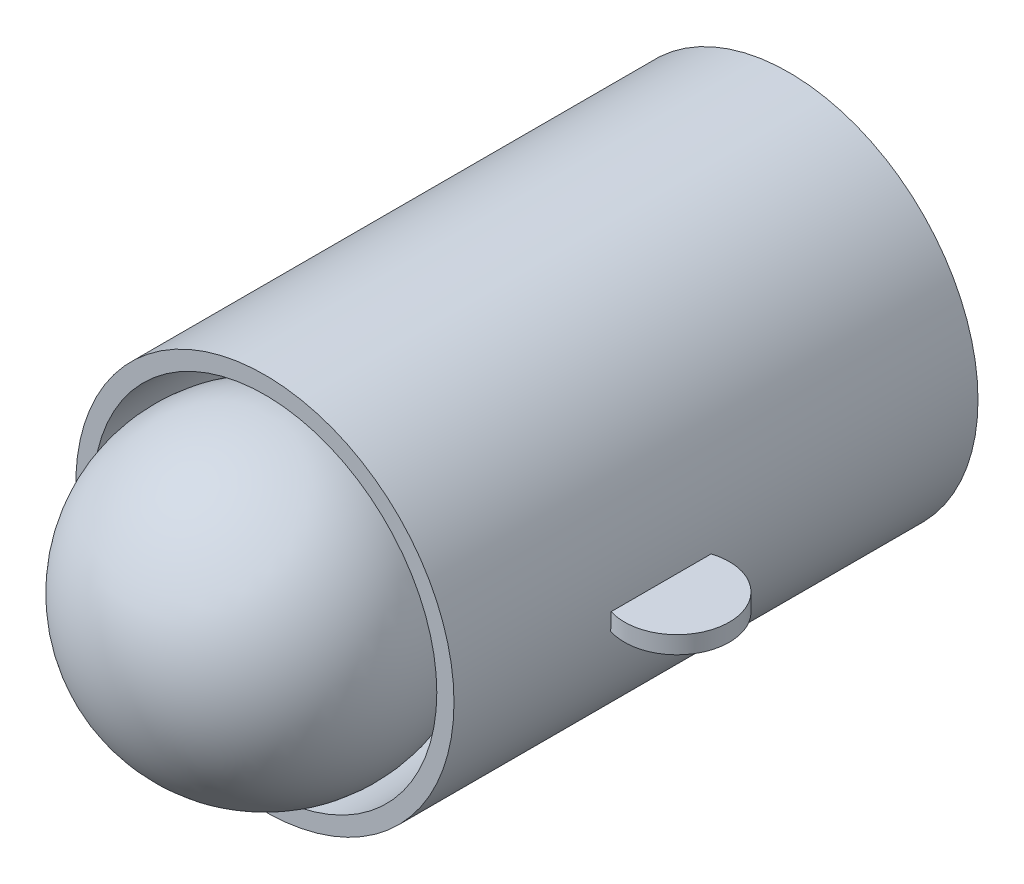
ISO-10303-21;
HEADER;
FILE_DESCRIPTION(('STEP AP214'),'2;1');
FILE_NAME('part.step','',(''),(''),'','','');
FILE_SCHEMA(('AUTOMOTIVE_DESIGN { 1 0 10303 214 1 1 1 1 }'));
ENDSEC;
DATA;
#1=APPLICATION_CONTEXT('core data for automotive mechanical design processes');
#2=APPLICATION_PROTOCOL_DEFINITION('international standard','automotive_design',2000,#1);
#3=PRODUCT_CONTEXT('',#1,'mechanical');
#4=PRODUCT('Part','Part','',(#3));
#5=PRODUCT_RELATED_PRODUCT_CATEGORY('part','',(#4));
#6=PRODUCT_DEFINITION_FORMATION('','',#4);
#7=PRODUCT_DEFINITION_CONTEXT('part definition',#1,'design');
#8=PRODUCT_DEFINITION('design','',#6,#7);
#9=PRODUCT_DEFINITION_SHAPE('','',#8);
#10=(LENGTH_UNIT() NAMED_UNIT(*) SI_UNIT(.MILLI.,.METRE.));
#11=(NAMED_UNIT(*) PLANE_ANGLE_UNIT() SI_UNIT($,.RADIAN.));
#12=(NAMED_UNIT(*) SI_UNIT($,.STERADIAN.) SOLID_ANGLE_UNIT());
#13=UNCERTAINTY_MEASURE_WITH_UNIT(LENGTH_MEASURE(1.E-05),#10,'distance_accuracy_value','');
#14=(GEOMETRIC_REPRESENTATION_CONTEXT(3) GLOBAL_UNCERTAINTY_ASSIGNED_CONTEXT((#13)) GLOBAL_UNIT_ASSIGNED_CONTEXT((#10,
#11,#12)) REPRESENTATION_CONTEXT('',''));
#15=CARTESIAN_POINT('',(0.,0.,0.));
#16=DIRECTION('',(0.,0.,1.));
#17=DIRECTION('',(1.,0.,0.));
#18=AXIS2_PLACEMENT_3D('',#15,#16,#17);
#19=CARTESIAN_POINT('',(0.,0.,76.2));
#20=DIRECTION('',(0.,1.,0.));
#21=DIRECTION('',(1.,0.,0.));
#22=AXIS2_PLACEMENT_3D('',#19,#20,#21);
#23=SPHERICAL_SURFACE('',#22,22.54);
#24=CARTESIAN_POINT('',(0.,22.54,76.2));
#25=VERTEX_POINT('',#24);
#26=VERTEX_LOOP('',#25);
#27=FACE_BOUND('',#26,.T.);
#28=ADVANCED_FACE('F43',(#27),#23,.T.);
#29=CLOSED_SHELL('',(#28));
#30=CARTESIAN_POINT('',(0.,0.,76.2));
#31=DIRECTION('',(0.,1.,0.));
#32=DIRECTION('',(1.,0.,0.));
#33=AXIS2_PLACEMENT_3D('',#30,#31,#32);
#34=SPHERICAL_SURFACE('',#33,20.);
#35=CARTESIAN_POINT('',(0.,20.,76.2));
#36=VERTEX_POINT('',#35);
#37=VERTEX_LOOP('',#36);
#38=FACE_BOUND('',#37,.T.);
#39=ADVANCED_FACE('F55',(#38),#34,.F.);
#40=CLOSED_SHELL('',(#39));
#41=ORIENTED_CLOSED_SHELL('',*,#40,.T.);
#42=BREP_WITH_VOIDS('B2',#29,(#41));
#43=CARTESIAN_POINT('',(0.,0.,76.2));
#44=DIRECTION('',(0.,0.,-1.));
#45=DIRECTION('',(-1.,0.,0.));
#46=AXIS2_PLACEMENT_3D('',#43,#44,#45);
#47=CYLINDRICAL_SURFACE('',#46,27.5);
#48=CARTESIAN_POINT('',(27.3824469322959,-2.54,38.8446913125485));
#49=CARTESIAN_POINT('',(27.402025367291,-2.32894215483723,38.8381673141535));
#50=CARTESIAN_POINT('',(27.4191647416801,-2.11763131286099,38.8325338603298));
#51=CARTESIAN_POINT('',(27.4485461292673,-1.694756889963,38.8229634156629));
#52=CARTESIAN_POINT('',(27.46079103928,-1.4831935330892,38.8190254212463));
#53=CARTESIAN_POINT('',(27.4803874806153,-1.05981705379383,38.8127537464297));
#54=CARTESIAN_POINT('',(27.4877390171294,-0.848003931637478,38.8104200643277));
#55=CARTESIAN_POINT('',(27.4975470367887,-0.424127191512888,38.8073166118748));
#56=CARTESIAN_POINT('',(27.5000006142577,-0.212063499484554,38.8065477698479));
#57=CARTESIAN_POINT('',(27.5,0.,38.8065424991184));
#58=B_SPLINE_CURVE_WITH_KNOTS('',3,(#48,#49,#50,#51,#52,#53,#54,#55,#56,#57),.UNSPECIFIED.,.F.,
.F.,(4,2,2,2,4),(0.,0.6361758886754,1.27197469377839,1.90777282434556,2.54394802527079),.UNSPECIFIED.);
#59=CARTESIAN_POINT('',(27.3824469322959,-2.54,38.8446913125485));
#60=VERTEX_POINT('',#59);
#61=CARTESIAN_POINT('',(27.5,0.,38.8065424991184));
#62=VERTEX_POINT('',#61);
#63=EDGE_CURVE('E83',#60,#62,#58,.T.);
#64=ORIENTED_EDGE('',*,*,#63,.F.);
#65=DIRECTION('',(0.,0.,-1.));
#66=VECTOR('',#65,1.);
#67=CARTESIAN_POINT('',(27.3824469322959,-2.54,76.2));
#68=LINE('',#67,#66);
#69=CARTESIAN_POINT('',(27.3824469322959,-2.54,53.3018511865699));
#70=VERTEX_POINT('',#69);
#71=EDGE_CURVE('E87',#60,#70,#68,.F.);
#72=ORIENTED_EDGE('',*,*,#71,.T.);
#73=CARTESIAN_POINT('',(27.5,0.,53.34));
#74=CARTESIAN_POINT('',(27.5000006142577,-0.212063499484554,53.3399947292705));
#75=CARTESIAN_POINT('',(27.4975470367887,-0.424127191512888,53.3392258872435));
#76=CARTESIAN_POINT('',(27.4877390171294,-0.848003931637478,53.3361224347906));
#77=CARTESIAN_POINT('',(27.4803874806153,-1.05981705379383,53.3337887526886));
#78=CARTESIAN_POINT('',(27.46079103928,-1.4831935330892,53.3275170778721));
#79=CARTESIAN_POINT('',(27.4485461292673,-1.694756889963,53.3235790834554));
#80=CARTESIAN_POINT('',(27.4191647416801,-2.11763131286099,53.3140086387885));
#81=CARTESIAN_POINT('',(27.402025367291,-2.32894215483723,53.3083751849649));
#82=CARTESIAN_POINT('',(27.3824469322959,-2.54,53.3018511865699));
#83=B_SPLINE_CURVE_WITH_KNOTS('',3,(#73,#74,#75,#76,#77,#78,#79,#80,#81,#82),.UNSPECIFIED.,.F.,
.F.,(4,2,2,2,4),(0.,0.636175200925234,1.2719733314924,1.90777213659539,2.54394802527079),.UNSPECIFIED.);
#84=CARTESIAN_POINT('',(27.5,0.,53.34));
#85=VERTEX_POINT('',#84);
#86=EDGE_CURVE('E103',#85,#70,#83,.T.);
#87=ORIENTED_EDGE('',*,*,#86,.F.);
#88=DIRECTION('',(0.,0.,-1.));
#89=VECTOR('',#88,1.);
#90=CARTESIAN_POINT('',(27.5,0.,76.2));
#91=LINE('',#90,#89);
#92=EDGE_CURVE('E106',#62,#85,#91,.F.);
#93=ORIENTED_EDGE('',*,*,#92,.F.);
#94=EDGE_LOOP('',(#64,#72,#87,#93));
#95=FACE_BOUND('',#94,.T.);
#96=CARTESIAN_POINT('',(0.,0.,76.2));
#97=DIRECTION('',(0.,0.,1.));
#98=DIRECTION('',(1.,0.,0.));
#99=AXIS2_PLACEMENT_3D('',#96,#97,#98);
#100=CIRCLE('',#99,27.5);
#101=CARTESIAN_POINT('',(27.5,0.,76.2));
#102=VERTEX_POINT('',#101);
#103=EDGE_CURVE('E168',#102,#102,#100,.T.);
#104=ORIENTED_EDGE('',*,*,#103,.F.);
#105=EDGE_LOOP('',(#104));
#106=FACE_BOUND('',#105,.T.);
#107=CARTESIAN_POINT('',(0.,0.,0.));
#108=DIRECTION('',(0.,0.,1.));
#109=DIRECTION('',(1.,0.,0.));
#110=AXIS2_PLACEMENT_3D('',#107,#108,#109);
#111=CIRCLE('',#110,27.5);
#112=CARTESIAN_POINT('',(27.5,0.,0.));
#113=VERTEX_POINT('',#112);
#114=EDGE_CURVE('E171',#113,#113,#111,.T.);
#115=ORIENTED_EDGE('',*,*,#114,.T.);
#116=EDGE_LOOP('',(#115));
#117=FACE_BOUND('',#116,.T.);
#118=ADVANCED_FACE('F68',(#95,#106,#117),#47,.T.);
#119=CARTESIAN_POINT('',(0.,0.,76.2));
#120=DIRECTION('',(0.,0.,1.));
#121=DIRECTION('',(1.,0.,0.));
#122=AXIS2_PLACEMENT_3D('',#119,#120,#121);
#123=PLANE('',#122);
#124=CARTESIAN_POINT('',(0.,0.,76.2));
#125=DIRECTION('',(0.,0.,1.));
#126=DIRECTION('',(1.,0.,0.));
#127=AXIS2_PLACEMENT_3D('',#124,#125,#126);
#128=CIRCLE('',#127,25.);
#129=CARTESIAN_POINT('',(25.,0.,76.2));
#130=VERTEX_POINT('',#129);
#131=EDGE_CURVE('E177',#130,#130,#128,.T.);
#132=ORIENTED_EDGE('',*,*,#131,.F.);
#133=EDGE_LOOP('',(#132));
#134=FACE_BOUND('',#133,.T.);
#135=ORIENTED_EDGE('',*,*,#103,.T.);
#136=EDGE_LOOP('',(#135));
#137=FACE_BOUND('',#136,.T.);
#138=ADVANCED_FACE('F191',(#134,#137),#123,.T.);
#139=CARTESIAN_POINT('',(0.,0.,0.));
#140=DIRECTION('',(0.,0.,1.));
#141=DIRECTION('',(1.,0.,0.));
#142=AXIS2_PLACEMENT_3D('',#139,#140,#141);
#143=PLANE('',#142);
#144=CARTESIAN_POINT('',(0.,0.,0.));
#145=DIRECTION('',(0.,0.,1.));
#146=DIRECTION('',(1.,0.,0.));
#147=AXIS2_PLACEMENT_3D('',#144,#145,#146);
#148=CIRCLE('',#147,25.);
#149=CARTESIAN_POINT('',(25.,0.,0.));
#150=VERTEX_POINT('',#149);
#151=EDGE_CURVE('E175',#150,#150,#148,.T.);
#152=ORIENTED_EDGE('',*,*,#151,.T.);
#153=EDGE_LOOP('',(#152));
#154=FACE_BOUND('',#153,.T.);
#155=ORIENTED_EDGE('',*,*,#114,.F.);
#156=EDGE_LOOP('',(#155));
#157=FACE_BOUND('',#156,.T.);
#158=ADVANCED_FACE('F182',(#154,#157),#143,.F.);
#159=CARTESIAN_POINT('',(0.,0.,0.));
#160=DIRECTION('',(0.,0.,1.));
#161=DIRECTION('',(1.,0.,0.));
#162=AXIS2_PLACEMENT_3D('',#159,#160,#161);
#163=CYLINDRICAL_SURFACE('',#162,25.);
#164=CARTESIAN_POINT('',(24.8706332850613,-2.54,51.8898098087243));
#165=CARTESIAN_POINT('',(24.8921368750978,-2.32947038918646,51.9079949075508));
#166=CARTESIAN_POINT('',(24.9109830396714,-2.11846412955154,51.9237539801748));
#167=CARTESIAN_POINT('',(24.9433050129918,-1.695977230153,51.9505828871324));
#168=CARTESIAN_POINT('',(24.956786708043,-1.48449736782751,51.9616578620594));
#169=CARTESIAN_POINT('',(24.9783716542752,-1.06107905615521,51.9793205674802));
#170=CARTESIAN_POINT('',(24.9864749374817,-0.849140609546556,51.985908324693));
#171=CARTESIAN_POINT('',(24.9972931507059,-0.42480123307418,51.9946806724225));
#172=CARTESIAN_POINT('',(25.000002135941,-0.212400050930283,51.9968604051199));
#173=CARTESIAN_POINT('',(25.,0.,51.9968709849559));
#174=B_SPLINE_CURVE_WITH_KNOTS('',3,(#164,#165,#166,#167,#168,#169,#170,#171,#172,#173),
.UNSPECIFIED.,.F.,.F.,(4,2,2,2,4),(0.,0.637177252663305,1.27365340506382,1.91012576755893,
2.54729916667436),.UNSPECIFIED.);
#175=CARTESIAN_POINT('',(24.8706332850613,-2.54,51.8898098087243));
#176=VERTEX_POINT('',#175);
#177=CARTESIAN_POINT('',(25.,0.,51.9968709849559));
#178=VERTEX_POINT('',#177);
#179=EDGE_CURVE('E76',#176,#178,#174,.T.);
#180=ORIENTED_EDGE('',*,*,#179,.F.);
#181=DIRECTION('',(0.,0.,1.));
#182=VECTOR('',#181,1.);
#183=CARTESIAN_POINT('',(24.8706332850613,-2.54,0.));
#184=LINE('',#183,#182);
#185=CARTESIAN_POINT('',(24.8706332850613,-2.54,40.2567326903941));
#186=VERTEX_POINT('',#185);
#187=EDGE_CURVE('E40',#176,#186,#184,.F.);
#188=ORIENTED_EDGE('',*,*,#187,.T.);
#189=CARTESIAN_POINT('',(25.,0.,40.1496715141625));
#190=CARTESIAN_POINT('',(25.000002135941,-0.212400050930283,40.1496820939985));
#191=CARTESIAN_POINT('',(24.9972931507059,-0.42480123307418,40.1518618266958));
#192=CARTESIAN_POINT('',(24.9864749374817,-0.849140609546555,40.1606341744254));
#193=CARTESIAN_POINT('',(24.9783716542752,-1.06107905615521,40.1672219316382));
#194=CARTESIAN_POINT('',(24.956786708043,-1.48449736782751,40.184884637059));
#195=CARTESIAN_POINT('',(24.9433050129918,-1.695977230153,40.1959596119859));
#196=CARTESIAN_POINT('',(24.9109830396714,-2.11846412955154,40.2227885189436));
#197=CARTESIAN_POINT('',(24.8921368750978,-2.32947038918646,40.2385475915676));
#198=CARTESIAN_POINT('',(24.8706332850613,-2.54,40.2567326903941));
#199=B_SPLINE_CURVE_WITH_KNOTS('',3,(#189,#190,#191,#192,#193,#194,#195,#196,#197,#198),
.UNSPECIFIED.,.F.,.F.,(4,2,2,2,4),(0.,0.637173399115436,1.27364576161055,1.91012191401106,
2.54729916667436),.UNSPECIFIED.);
#200=CARTESIAN_POINT('',(25.,0.,40.1496715141625));
#201=VERTEX_POINT('',#200);
#202=EDGE_CURVE('E149',#201,#186,#199,.T.);
#203=ORIENTED_EDGE('',*,*,#202,.F.);
#204=DIRECTION('',(0.,0.,1.));
#205=VECTOR('',#204,1.);
#206=CARTESIAN_POINT('',(25.,0.,0.));
#207=LINE('',#206,#205);
#208=EDGE_CURVE('E165',#178,#201,#207,.F.);
#209=ORIENTED_EDGE('',*,*,#208,.F.);
#210=EDGE_LOOP('',(#180,#188,#203,#209));
#211=FACE_BOUND('',#210,.T.);
#212=ORIENTED_EDGE('',*,*,#151,.F.);
#213=EDGE_LOOP('',(#212));
#214=FACE_BOUND('',#213,.T.);
#215=ORIENTED_EDGE('',*,*,#131,.T.);
#216=EDGE_LOOP('',(#215));
#217=FACE_BOUND('',#216,.T.);
#218=ADVANCED_FACE('F143',(#211,#214,#217),#163,.F.);
#219=CARTESIAN_POINT('',(29.7932625814583,0.,46.0732712495592));
#220=DIRECTION('',(0.,-1.,0.));
#221=DIRECTION('',(0.,0.,-1.));
#222=AXIS2_PLACEMENT_3D('',#219,#220,#221);
#223=PLANE('',#222);
#224=CARTESIAN_POINT('',(29.7932625814583,0.,46.0732712495592));
#225=DIRECTION('',(0.,-1.,0.));
#226=DIRECTION('',(0.,0.,-1.));
#227=AXIS2_PLACEMENT_3D('',#224,#225,#226);
#228=CIRCLE('',#227,7.61999999999999);
#229=EDGE_CURVE('E119',#178,#201,#228,.T.);
#230=ORIENTED_EDGE('',*,*,#229,.F.);
#231=ORIENTED_EDGE('',*,*,#208,.T.);
#232=EDGE_LOOP('',(#230,#231));
#233=FACE_BOUND('',#232,.T.);
#234=ADVANCED_FACE('F187',(#233),#223,.F.);
#235=CARTESIAN_POINT('',(29.7932625814583,-2.54,46.0732712495592));
#236=DIRECTION('',(0.,-1.,0.));
#237=DIRECTION('',(0.,0.,-1.));
#238=AXIS2_PLACEMENT_3D('',#235,#236,#237);
#239=PLANE('',#238);
#240=ORIENTED_EDGE('',*,*,#187,.F.);
#241=CARTESIAN_POINT('',(29.7932625814583,-2.54,46.0732712495592));
#242=DIRECTION('',(0.,-1.,0.));
#243=DIRECTION('',(0.,0.,-1.));
#244=AXIS2_PLACEMENT_3D('',#241,#242,#243);
#245=CIRCLE('',#244,7.61999999999999);
#246=EDGE_CURVE('E116',#176,#186,#245,.T.);
#247=ORIENTED_EDGE('',*,*,#246,.T.);
#248=EDGE_LOOP('',(#240,#247));
#249=FACE_BOUND('',#248,.T.);
#250=ADVANCED_FACE('F214',(#249),#239,.T.);
#251=CARTESIAN_POINT('',(29.7932625814583,-2.54,46.0732712495592));
#252=DIRECTION('',(0.,1.,0.));
#253=DIRECTION('',(0.,0.,1.));
#254=AXIS2_PLACEMENT_3D('',#251,#252,#253);
#255=CYLINDRICAL_SURFACE('',#254,7.61999999999999);
#256=ORIENTED_EDGE('',*,*,#246,.F.);
#257=ORIENTED_EDGE('',*,*,#179,.T.);
#258=ORIENTED_EDGE('',*,*,#229,.T.);
#259=ORIENTED_EDGE('',*,*,#202,.T.);
#260=EDGE_LOOP('',(#256,#257,#258,#259));
#261=FACE_BOUND('',#260,.T.);
#262=ADVANCED_FACE('F141',(#261),#255,.T.);
#263=EDGE_CURVE('E122',#60,#70,#245,.T.);
#264=ORIENTED_EDGE('',*,*,#263,.F.);
#265=ORIENTED_EDGE('',*,*,#63,.T.);
#266=EDGE_CURVE('E115',#62,#85,#228,.T.);
#267=ORIENTED_EDGE('',*,*,#266,.T.);
#268=ORIENTED_EDGE('',*,*,#86,.T.);
#269=EDGE_LOOP('',(#264,#265,#267,#268));
#270=FACE_BOUND('',#269,.T.);
#271=ADVANCED_FACE('F118',(#270),#255,.T.);
#272=ORIENTED_EDGE('',*,*,#71,.F.);
#273=ORIENTED_EDGE('',*,*,#263,.T.);
#274=EDGE_LOOP('',(#272,#273));
#275=FACE_BOUND('',#274,.T.);
#276=ADVANCED_FACE('F140',(#275),#239,.T.);
#277=ORIENTED_EDGE('',*,*,#266,.F.);
#278=ORIENTED_EDGE('',*,*,#92,.T.);
#279=EDGE_LOOP('',(#277,#278));
#280=FACE_BOUND('',#279,.T.);
#281=ADVANCED_FACE('F114',(#280),#223,.F.);
#282=CLOSED_SHELL('',(#118,#138,#158,#218,#234,#250,#262,#271,#276,#281));
#283=MANIFOLD_SOLID_BREP('B6',#282);
#284=ADVANCED_BREP_SHAPE_REPRESENTATION('',(#18,#42,#283),#14);
#285=SHAPE_DEFINITION_REPRESENTATION(#9,#284);
ENDSEC;
END-ISO-10303-21;
